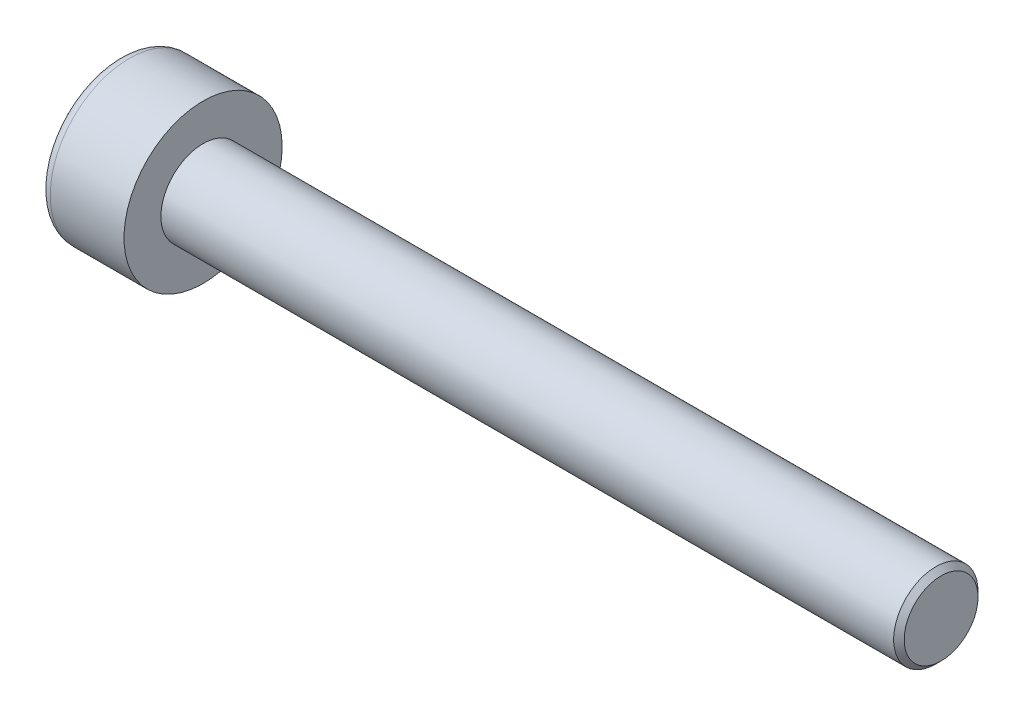
ISO-10303-21;
HEADER;
FILE_DESCRIPTION(('STEP AP214'),'2;1');
FILE_NAME('part.step','',(''),(''),'','','');
FILE_SCHEMA(('AUTOMOTIVE_DESIGN { 1 0 10303 214 1 1 1 1 }'));
ENDSEC;
DATA;
#1=APPLICATION_CONTEXT('core data for automotive mechanical design processes');
#2=APPLICATION_PROTOCOL_DEFINITION('international standard','automotive_design',2000,#1);
#3=PRODUCT_CONTEXT('',#1,'mechanical');
#4=PRODUCT('Part','Part','',(#3));
#5=PRODUCT_RELATED_PRODUCT_CATEGORY('part','',(#4));
#6=PRODUCT_DEFINITION_FORMATION('','',#4);
#7=PRODUCT_DEFINITION_CONTEXT('part definition',#1,'design');
#8=PRODUCT_DEFINITION('design','',#6,#7);
#9=PRODUCT_DEFINITION_SHAPE('','',#8);
#10=(LENGTH_UNIT() NAMED_UNIT(*) SI_UNIT(.MILLI.,.METRE.));
#11=(NAMED_UNIT(*) PLANE_ANGLE_UNIT() SI_UNIT($,.RADIAN.));
#12=(NAMED_UNIT(*) SI_UNIT($,.STERADIAN.) SOLID_ANGLE_UNIT());
#13=UNCERTAINTY_MEASURE_WITH_UNIT(LENGTH_MEASURE(1.E-05),#10,'distance_accuracy_value','');
#14=(GEOMETRIC_REPRESENTATION_CONTEXT(3) GLOBAL_UNCERTAINTY_ASSIGNED_CONTEXT((#13)) GLOBAL_UNIT_ASSIGNED_CONTEXT((#10,
#11,#12)) REPRESENTATION_CONTEXT('',''));
#15=CARTESIAN_POINT('',(0.,0.,0.));
#16=DIRECTION('',(0.,0.,1.));
#17=DIRECTION('',(1.,0.,0.));
#18=AXIS2_PLACEMENT_3D('',#15,#16,#17);
#19=CARTESIAN_POINT('',(0.7,0.,-0.866025403784446));
#20=DIRECTION('',(1.,0.,0.));
#21=DIRECTION('',(0.,0.,-1.));
#22=AXIS2_PLACEMENT_3D('',#19,#20,#21);
#23=PLANE('',#22);
#24=CARTESIAN_POINT('',(0.7,0.,0.));
#25=DIRECTION('',(1.,0.,0.));
#26=DIRECTION('',(0.,0.,-1.));
#27=AXIS2_PLACEMENT_3D('',#24,#25,#26);
#28=CIRCLE('',#27,0.750000000000004);
#29=CARTESIAN_POINT('',(0.7,-0.375000000000009,-0.649519052838328));
#30=VERTEX_POINT('',#29);
#31=CARTESIAN_POINT('',(0.7,-0.750000000000004,0.));
#32=VERTEX_POINT('',#31);
#33=EDGE_CURVE('E160',#30,#32,#28,.F.);
#34=ORIENTED_EDGE('',*,*,#33,.F.);
#35=DIRECTION('',(0.,0.866025403784433,-0.50000000000001));
#36=VECTOR('',#35,1.);
#37=CARTESIAN_POINT('',(0.7,-0.75,-0.43301270189222));
#38=LINE('',#37,#36);
#39=CARTESIAN_POINT('',(0.7,-0.75,-0.43301270189222));
#40=VERTEX_POINT('',#39);
#41=EDGE_CURVE('E168',#40,#30,#38,.T.);
#42=ORIENTED_EDGE('',*,*,#41,.F.);
#43=DIRECTION('',(0.,0.,-1.));
#44=VECTOR('',#43,1.);
#45=CARTESIAN_POINT('',(0.7,-0.750000000000004,0.433012701892211));
#46=LINE('',#45,#44);
#47=EDGE_CURVE('E185',#32,#40,#46,.T.);
#48=ORIENTED_EDGE('',*,*,#47,.F.);
#49=EDGE_LOOP('',(#34,#42,#48));
#50=FACE_BOUND('',#49,.T.);
#51=ADVANCED_FACE('F37',(#50),#23,.F.);
#52=CARTESIAN_POINT('',(0.7,-0.375000000000007,0.64951905283833));
#53=VERTEX_POINT('',#52);
#54=EDGE_CURVE('E290',#32,#53,#28,.F.);
#55=ORIENTED_EDGE('',*,*,#54,.F.);
#56=CARTESIAN_POINT('',(0.7,-0.750000000000004,0.433012701892211));
#57=VERTEX_POINT('',#56);
#58=EDGE_CURVE('E186',#57,#32,#46,.T.);
#59=ORIENTED_EDGE('',*,*,#58,.F.);
#60=DIRECTION('',(0.,-0.866025403784435,-0.500000000000006));
#61=VECTOR('',#60,1.);
#62=CARTESIAN_POINT('',(0.7,0.,0.866025403784436));
#63=LINE('',#62,#61);
#64=EDGE_CURVE('E181',#53,#57,#63,.T.);
#65=ORIENTED_EDGE('',*,*,#64,.F.);
#66=EDGE_LOOP('',(#55,#59,#65));
#67=FACE_BOUND('',#66,.T.);
#68=ADVANCED_FACE('F126',(#67),#23,.F.);
#69=CARTESIAN_POINT('',(0.7,0.374999999999996,0.649519052838336));
#70=VERTEX_POINT('',#69);
#71=EDGE_CURVE('E286',#53,#70,#28,.F.);
#72=ORIENTED_EDGE('',*,*,#71,.F.);
#73=CARTESIAN_POINT('',(0.7,0.,0.866025403784436));
#74=VERTEX_POINT('',#73);
#75=EDGE_CURVE('E182',#74,#53,#63,.T.);
#76=ORIENTED_EDGE('',*,*,#75,.F.);
#77=DIRECTION('',(0.,-0.866025403784443,0.499999999999991));
#78=VECTOR('',#77,1.);
#79=CARTESIAN_POINT('',(0.7,0.749999999999999,0.433012701892223));
#80=LINE('',#79,#78);
#81=EDGE_CURVE('E177',#70,#74,#80,.T.);
#82=ORIENTED_EDGE('',*,*,#81,.F.);
#83=EDGE_LOOP('',(#72,#76,#82));
#84=FACE_BOUND('',#83,.T.);
#85=ADVANCED_FACE('F132',(#84),#23,.F.);
#86=CARTESIAN_POINT('',(0.7,0.750000000000004,0.));
#87=VERTEX_POINT('',#86);
#88=EDGE_CURVE('E157',#70,#87,#28,.F.);
#89=ORIENTED_EDGE('',*,*,#88,.F.);
#90=CARTESIAN_POINT('',(0.7,0.749999999999999,0.433012701892223));
#91=VERTEX_POINT('',#90);
#92=EDGE_CURVE('E178',#91,#70,#80,.T.);
#93=ORIENTED_EDGE('',*,*,#92,.F.);
#94=DIRECTION('',(0.,0.,1.));
#95=VECTOR('',#94,1.);
#96=CARTESIAN_POINT('',(0.7,0.750000000000006,-0.433012701892211));
#97=LINE('',#96,#95);
#98=EDGE_CURVE('E172',#87,#91,#97,.T.);
#99=ORIENTED_EDGE('',*,*,#98,.F.);
#100=EDGE_LOOP('',(#89,#93,#99));
#101=FACE_BOUND('',#100,.T.);
#102=ADVANCED_FACE('F146',(#101),#23,.F.);
#103=CARTESIAN_POINT('',(0.7,0.,0.));
#104=DIRECTION('',(1.,0.,0.));
#105=DIRECTION('',(0.,0.,-1.));
#106=AXIS2_PLACEMENT_3D('',#103,#104,#105);
#107=CIRCLE('',#106,0.750000000000004);
#108=CARTESIAN_POINT('',(0.7,0.375000000000005,-0.649519052838325));
#109=VERTEX_POINT('',#108);
#110=EDGE_CURVE('E52',#109,#87,#107,.T.);
#111=ORIENTED_EDGE('',*,*,#110,.T.);
#112=CARTESIAN_POINT('',(0.7,0.750000000000006,-0.433012701892211));
#113=VERTEX_POINT('',#112);
#114=EDGE_CURVE('E165',#113,#87,#97,.T.);
#115=ORIENTED_EDGE('',*,*,#114,.F.);
#116=DIRECTION('',(0.,0.866025403784434,0.500000000000008));
#117=VECTOR('',#116,1.);
#118=CARTESIAN_POINT('',(0.7,0.,-0.866025403784446));
#119=LINE('',#118,#117);
#120=EDGE_CURVE('E162',#109,#113,#119,.T.);
#121=ORIENTED_EDGE('',*,*,#120,.F.);
#122=EDGE_LOOP('',(#111,#115,#121));
#123=FACE_BOUND('',#122,.T.);
#124=ADVANCED_FACE('F137',(#123),#23,.F.);
#125=EDGE_CURVE('E150',#109,#30,#28,.F.);
#126=ORIENTED_EDGE('',*,*,#125,.F.);
#127=CARTESIAN_POINT('',(0.7,0.,-0.866025403784446));
#128=VERTEX_POINT('',#127);
#129=EDGE_CURVE('E153',#128,#109,#119,.T.);
#130=ORIENTED_EDGE('',*,*,#129,.F.);
#131=EDGE_CURVE('E155',#30,#128,#38,.T.);
#132=ORIENTED_EDGE('',*,*,#131,.F.);
#133=EDGE_LOOP('',(#126,#130,#132));
#134=FACE_BOUND('',#133,.T.);
#135=ADVANCED_FACE('F128',(#134),#23,.F.);
#136=CARTESIAN_POINT('',(0.,0.,0.));
#137=DIRECTION('',(1.,0.,0.));
#138=DIRECTION('',(0.,0.,-1.));
#139=AXIS2_PLACEMENT_3D('',#136,#137,#138);
#140=PLANE('',#139);
#141=CARTESIAN_POINT('',(0.,0.,0.));
#142=DIRECTION('',(1.,0.,0.));
#143=DIRECTION('',(0.,0.,-1.));
#144=AXIS2_PLACEMENT_3D('',#141,#142,#143);
#145=CIRCLE('',#144,1.3);
#146=CARTESIAN_POINT('',(0.,0.,-1.3));
#147=VERTEX_POINT('',#146);
#148=EDGE_CURVE('E225',#147,#147,#145,.F.);
#149=ORIENTED_EDGE('',*,*,#148,.T.);
#150=EDGE_LOOP('',(#149));
#151=FACE_BOUND('',#150,.T.);
#152=DIRECTION('',(0.,0.866025403784433,-0.50000000000001));
#153=VECTOR('',#152,1.);
#154=CARTESIAN_POINT('',(0.,-0.75,-0.43301270189222));
#155=LINE('',#154,#153);
#156=CARTESIAN_POINT('',(0.,-0.75,-0.43301270189222));
#157=VERTEX_POINT('',#156);
#158=CARTESIAN_POINT('',(0.,0.,-0.866025403784446));
#159=VERTEX_POINT('',#158);
#160=EDGE_CURVE('E60',#157,#159,#155,.T.);
#161=ORIENTED_EDGE('',*,*,#160,.T.);
#162=DIRECTION('',(0.,0.866025403784434,0.500000000000008));
#163=VECTOR('',#162,1.);
#164=CARTESIAN_POINT('',(0.,0.,-0.866025403784446));
#165=LINE('',#164,#163);
#166=CARTESIAN_POINT('',(0.,0.750000000000006,-0.433012701892211));
#167=VERTEX_POINT('',#166);
#168=EDGE_CURVE('E191',#159,#167,#165,.T.);
#169=ORIENTED_EDGE('',*,*,#168,.T.);
#170=DIRECTION('',(0.,0.,1.));
#171=VECTOR('',#170,1.);
#172=CARTESIAN_POINT('',(0.,0.750000000000006,-0.433012701892211));
#173=LINE('',#172,#171);
#174=CARTESIAN_POINT('',(0.,0.749999999999999,0.433012701892223));
#175=VERTEX_POINT('',#174);
#176=EDGE_CURVE('E194',#167,#175,#173,.T.);
#177=ORIENTED_EDGE('',*,*,#176,.T.);
#178=DIRECTION('',(0.,-0.866025403784443,0.499999999999991));
#179=VECTOR('',#178,1.);
#180=CARTESIAN_POINT('',(0.,0.749999999999999,0.433012701892223));
#181=LINE('',#180,#179);
#182=CARTESIAN_POINT('',(0.,0.,0.866025403784436));
#183=VERTEX_POINT('',#182);
#184=EDGE_CURVE('E197',#175,#183,#181,.T.);
#185=ORIENTED_EDGE('',*,*,#184,.T.);
#186=DIRECTION('',(0.,-0.866025403784435,-0.500000000000006));
#187=VECTOR('',#186,1.);
#188=CARTESIAN_POINT('',(0.,0.,0.866025403784436));
#189=LINE('',#188,#187);
#190=CARTESIAN_POINT('',(0.,-0.750000000000004,0.433012701892211));
#191=VERTEX_POINT('',#190);
#192=EDGE_CURVE('E200',#183,#191,#189,.T.);
#193=ORIENTED_EDGE('',*,*,#192,.T.);
#194=DIRECTION('',(0.,0.,-1.));
#195=VECTOR('',#194,1.);
#196=CARTESIAN_POINT('',(0.,-0.750000000000004,0.433012701892211));
#197=LINE('',#196,#195);
#198=EDGE_CURVE('E203',#191,#157,#197,.T.);
#199=ORIENTED_EDGE('',*,*,#198,.T.);
#200=EDGE_LOOP('',(#161,#169,#177,#185,#193,#199));
#201=FACE_BOUND('',#200,.T.);
#202=ADVANCED_FACE('F136',(#151,#201),#140,.F.);
#203=CARTESIAN_POINT('',(1.6,0.,0.));
#204=DIRECTION('',(1.,0.,0.));
#205=DIRECTION('',(0.,0.,-1.));
#206=AXIS2_PLACEMENT_3D('',#203,#204,#205);
#207=PLANE('',#206);
#208=CARTESIAN_POINT('',(1.6,0.,0.));
#209=DIRECTION('',(1.,0.,0.));
#210=DIRECTION('',(0.,0.,-1.));
#211=AXIS2_PLACEMENT_3D('',#208,#209,#210);
#212=CIRCLE('',#211,1.5);
#213=CARTESIAN_POINT('',(1.6,0.,-1.5));
#214=VERTEX_POINT('',#213);
#215=EDGE_CURVE('E158',#214,#214,#212,.T.);
#216=ORIENTED_EDGE('',*,*,#215,.T.);
#217=EDGE_LOOP('',(#216));
#218=FACE_BOUND('',#217,.T.);
#219=CARTESIAN_POINT('',(1.6,0.,0.));
#220=DIRECTION('',(1.,0.,0.));
#221=DIRECTION('',(0.,0.,-1.));
#222=AXIS2_PLACEMENT_3D('',#219,#220,#221);
#223=CIRCLE('',#222,0.8);
#224=CARTESIAN_POINT('',(1.6,0.,-0.8));
#225=VERTEX_POINT('',#224);
#226=EDGE_CURVE('E216',#225,#225,#223,.T.);
#227=ORIENTED_EDGE('',*,*,#226,.F.);
#228=EDGE_LOOP('',(#227));
#229=FACE_BOUND('',#228,.T.);
#230=ADVANCED_FACE('F143',(#218,#229),#207,.T.);
#231=CARTESIAN_POINT('',(1.6,0.,0.));
#232=DIRECTION('',(-1.,0.,0.));
#233=DIRECTION('',(0.,0.,1.));
#234=AXIS2_PLACEMENT_3D('',#231,#232,#233);
#235=CYLINDRICAL_SURFACE('',#234,1.5);
#236=CARTESIAN_POINT('',(0.2,0.,0.));
#237=DIRECTION('',(1.,0.,0.));
#238=DIRECTION('',(0.,0.,-1.));
#239=AXIS2_PLACEMENT_3D('',#236,#237,#238);
#240=CIRCLE('',#239,1.5);
#241=CARTESIAN_POINT('',(0.2,0.,-1.5));
#242=VERTEX_POINT('',#241);
#243=EDGE_CURVE('E222',#242,#242,#240,.T.);
#244=ORIENTED_EDGE('',*,*,#243,.T.);
#245=EDGE_LOOP('',(#244));
#246=FACE_BOUND('',#245,.T.);
#247=ORIENTED_EDGE('',*,*,#215,.F.);
#248=EDGE_LOOP('',(#247));
#249=FACE_BOUND('',#248,.T.);
#250=ADVANCED_FACE('F241',(#246,#249),#235,.T.);
#251=CARTESIAN_POINT('',(15.6,0.,0.));
#252=DIRECTION('',(-1.,0.,0.));
#253=DIRECTION('',(0.,0.,1.));
#254=AXIS2_PLACEMENT_3D('',#251,#252,#253);
#255=CYLINDRICAL_SURFACE('',#254,0.8);
#256=CARTESIAN_POINT('',(15.5,0.,0.));
#257=DIRECTION('',(1.,0.,0.));
#258=DIRECTION('',(0.,0.,-1.));
#259=AXIS2_PLACEMENT_3D('',#256,#257,#258);
#260=CIRCLE('',#259,0.8);
#261=CARTESIAN_POINT('',(15.5,0.,-0.8));
#262=VERTEX_POINT('',#261);
#263=EDGE_CURVE('E11',#262,#262,#260,.F.);
#264=ORIENTED_EDGE('',*,*,#263,.T.);
#265=EDGE_LOOP('',(#264));
#266=FACE_BOUND('',#265,.T.);
#267=ORIENTED_EDGE('',*,*,#226,.T.);
#268=EDGE_LOOP('',(#267));
#269=FACE_BOUND('',#268,.T.);
#270=ADVANCED_FACE('F238',(#266,#269),#255,.T.);
#271=CARTESIAN_POINT('',(15.6,0.,0.));
#272=DIRECTION('',(1.,0.,0.));
#273=DIRECTION('',(0.,0.,-1.));
#274=AXIS2_PLACEMENT_3D('',#271,#272,#273);
#275=PLANE('',#274);
#276=CARTESIAN_POINT('',(15.6,0.,0.));
#277=DIRECTION('',(1.,0.,0.));
#278=DIRECTION('',(0.,0.,-1.));
#279=AXIS2_PLACEMENT_3D('',#276,#277,#278);
#280=CIRCLE('',#279,0.699999999999998);
#281=CARTESIAN_POINT('',(15.6,0.,-0.699999999999998));
#282=VERTEX_POINT('',#281);
#283=EDGE_CURVE('E45',#282,#282,#280,.T.);
#284=ORIENTED_EDGE('',*,*,#283,.T.);
#285=EDGE_LOOP('',(#284));
#286=FACE_BOUND('',#285,.T.);
#287=ADVANCED_FACE('F230',(#286),#275,.T.);
#288=CARTESIAN_POINT('',(0.7,-0.75,-0.43301270189222));
#289=DIRECTION('',(0.,0.50000000000001,0.866025403784433));
#290=DIRECTION('',(0.,-0.866025403784433,0.50000000000001));
#291=AXIS2_PLACEMENT_3D('',#288,#289,#290);
#292=PLANE('',#291);
#293=ORIENTED_EDGE('',*,*,#160,.F.);
#294=DIRECTION('',(-1.,0.,0.));
#295=VECTOR('',#294,1.);
#296=CARTESIAN_POINT('',(0.7,-0.75,-0.43301270189222));
#297=LINE('',#296,#295);
#298=EDGE_CURVE('E189',#40,#157,#297,.T.);
#299=ORIENTED_EDGE('',*,*,#298,.F.);
#300=ORIENTED_EDGE('',*,*,#41,.T.);
#301=ORIENTED_EDGE('',*,*,#131,.T.);
#302=DIRECTION('',(-1.,0.,0.));
#303=VECTOR('',#302,1.);
#304=CARTESIAN_POINT('',(0.7,0.,-0.866025403784446));
#305=LINE('',#304,#303);
#306=EDGE_CURVE('E171',#128,#159,#305,.T.);
#307=ORIENTED_EDGE('',*,*,#306,.T.);
#308=EDGE_LOOP('',(#293,#299,#300,#301,#307));
#309=FACE_BOUND('',#308,.T.);
#310=ADVANCED_FACE('F256',(#309),#292,.T.);
#311=CARTESIAN_POINT('',(0.7,0.,-0.866025403784446));
#312=DIRECTION('',(0.,-0.500000000000008,0.866025403784434));
#313=DIRECTION('',(0.,-0.866025403784434,-0.500000000000008));
#314=AXIS2_PLACEMENT_3D('',#311,#312,#313);
#315=PLANE('',#314);
#316=ORIENTED_EDGE('',*,*,#168,.F.);
#317=ORIENTED_EDGE('',*,*,#306,.F.);
#318=ORIENTED_EDGE('',*,*,#129,.T.);
#319=ORIENTED_EDGE('',*,*,#120,.T.);
#320=DIRECTION('',(-1.,0.,0.));
#321=VECTOR('',#320,1.);
#322=CARTESIAN_POINT('',(0.7,0.750000000000006,-0.433012701892211));
#323=LINE('',#322,#321);
#324=EDGE_CURVE('E213',#113,#167,#323,.T.);
#325=ORIENTED_EDGE('',*,*,#324,.T.);
#326=EDGE_LOOP('',(#316,#317,#318,#319,#325));
#327=FACE_BOUND('',#326,.T.);
#328=ADVANCED_FACE('F170',(#327),#315,.T.);
#329=CARTESIAN_POINT('',(0.7,0.750000000000006,-0.433012701892211));
#330=DIRECTION('',(0.,-1.,0.));
#331=DIRECTION('',(0.,0.,-1.));
#332=AXIS2_PLACEMENT_3D('',#329,#330,#331);
#333=PLANE('',#332);
#334=ORIENTED_EDGE('',*,*,#176,.F.);
#335=ORIENTED_EDGE('',*,*,#324,.F.);
#336=ORIENTED_EDGE('',*,*,#114,.T.);
#337=ORIENTED_EDGE('',*,*,#98,.T.);
#338=DIRECTION('',(-1.,0.,0.));
#339=VECTOR('',#338,1.);
#340=CARTESIAN_POINT('',(0.7,0.749999999999999,0.433012701892223));
#341=LINE('',#340,#339);
#342=EDGE_CURVE('E211',#91,#175,#341,.T.);
#343=ORIENTED_EDGE('',*,*,#342,.T.);
#344=EDGE_LOOP('',(#334,#335,#336,#337,#343));
#345=FACE_BOUND('',#344,.T.);
#346=ADVANCED_FACE('F261',(#345),#333,.T.);
#347=CARTESIAN_POINT('',(0.7,0.749999999999999,0.433012701892223));
#348=DIRECTION('',(0.,-0.499999999999992,-0.866025403784444));
#349=DIRECTION('',(0.,0.866025403784444,-0.499999999999992));
#350=AXIS2_PLACEMENT_3D('',#347,#348,#349);
#351=PLANE('',#350);
#352=ORIENTED_EDGE('',*,*,#184,.F.);
#353=ORIENTED_EDGE('',*,*,#342,.F.);
#354=ORIENTED_EDGE('',*,*,#92,.T.);
#355=ORIENTED_EDGE('',*,*,#81,.T.);
#356=DIRECTION('',(-1.,0.,0.));
#357=VECTOR('',#356,1.);
#358=CARTESIAN_POINT('',(0.7,0.,0.866025403784436));
#359=LINE('',#358,#357);
#360=EDGE_CURVE('E209',#74,#183,#359,.T.);
#361=ORIENTED_EDGE('',*,*,#360,.T.);
#362=EDGE_LOOP('',(#352,#353,#354,#355,#361));
#363=FACE_BOUND('',#362,.T.);
#364=ADVANCED_FACE('F264',(#363),#351,.T.);
#365=CARTESIAN_POINT('',(0.7,0.,0.866025403784436));
#366=DIRECTION('',(0.,0.500000000000006,-0.866025403784435));
#367=DIRECTION('',(0.,0.866025403784435,0.500000000000006));
#368=AXIS2_PLACEMENT_3D('',#365,#366,#367);
#369=PLANE('',#368);
#370=ORIENTED_EDGE('',*,*,#192,.F.);
#371=ORIENTED_EDGE('',*,*,#360,.F.);
#372=ORIENTED_EDGE('',*,*,#75,.T.);
#373=ORIENTED_EDGE('',*,*,#64,.T.);
#374=DIRECTION('',(-1.,0.,0.));
#375=VECTOR('',#374,1.);
#376=CARTESIAN_POINT('',(0.7,-0.750000000000004,0.433012701892211));
#377=LINE('',#376,#375);
#378=EDGE_CURVE('E207',#57,#191,#377,.T.);
#379=ORIENTED_EDGE('',*,*,#378,.T.);
#380=EDGE_LOOP('',(#370,#371,#372,#373,#379));
#381=FACE_BOUND('',#380,.T.);
#382=ADVANCED_FACE('F121',(#381),#369,.T.);
#383=CARTESIAN_POINT('',(0.7,-0.750000000000004,0.433012701892211));
#384=DIRECTION('',(0.,1.,0.));
#385=DIRECTION('',(0.,0.,1.));
#386=AXIS2_PLACEMENT_3D('',#383,#384,#385);
#387=PLANE('',#386);
#388=ORIENTED_EDGE('',*,*,#198,.F.);
#389=ORIENTED_EDGE('',*,*,#378,.F.);
#390=ORIENTED_EDGE('',*,*,#58,.T.);
#391=ORIENTED_EDGE('',*,*,#47,.T.);
#392=ORIENTED_EDGE('',*,*,#298,.T.);
#393=EDGE_LOOP('',(#388,#389,#390,#391,#392));
#394=FACE_BOUND('',#393,.T.);
#395=ADVANCED_FACE('F114',(#394),#387,.T.);
#396=CARTESIAN_POINT('',(0.7,0.,0.));
#397=DIRECTION('',(-1.,0.,0.));
#398=DIRECTION('',(0.,0.,1.));
#399=AXIS2_PLACEMENT_3D('',#396,#397,#398);
#400=CONICAL_SURFACE('',#399,0.750000000000004,1.04719755119659);
#401=CARTESIAN_POINT('',(1.13301270189223,0.,0.));
#402=VERTEX_POINT('',#401);
#403=VERTEX_LOOP('',#402);
#404=FACE_BOUND('',#403,.T.);
#405=ORIENTED_EDGE('',*,*,#110,.F.);
#406=ORIENTED_EDGE('',*,*,#125,.T.);
#407=ORIENTED_EDGE('',*,*,#33,.T.);
#408=ORIENTED_EDGE('',*,*,#54,.T.);
#409=ORIENTED_EDGE('',*,*,#71,.T.);
#410=ORIENTED_EDGE('',*,*,#88,.T.);
#411=EDGE_LOOP('',(#405,#406,#407,#408,#409,#410));
#412=FACE_BOUND('',#411,.T.);
#413=ADVANCED_FACE('F111',(#404,#412),#400,.F.);
#414=CARTESIAN_POINT('',(0.2,0.,0.));
#415=DIRECTION('',(1.,0.,0.));
#416=DIRECTION('',(0.,0.,-1.));
#417=AXIS2_PLACEMENT_3D('',#414,#415,#416);
#418=TOROIDAL_SURFACE('',#417,1.3,0.2);
#419=ORIENTED_EDGE('',*,*,#148,.F.);
#420=EDGE_LOOP('',(#419));
#421=FACE_BOUND('',#420,.T.);
#422=ORIENTED_EDGE('',*,*,#243,.F.);
#423=EDGE_LOOP('',(#422));
#424=FACE_BOUND('',#423,.T.);
#425=ADVANCED_FACE('F113',(#421,#424),#418,.T.);
#426=CARTESIAN_POINT('',(15.6,0.,0.));
#427=DIRECTION('',(-1.,0.,0.));
#428=DIRECTION('',(0.,0.,1.));
#429=AXIS2_PLACEMENT_3D('',#426,#427,#428);
#430=CONICAL_SURFACE('',#429,0.699999999999998,0.785398163397447);
#431=ORIENTED_EDGE('',*,*,#263,.F.);
#432=EDGE_LOOP('',(#431));
#433=FACE_BOUND('',#432,.T.);
#434=ORIENTED_EDGE('',*,*,#283,.F.);
#435=EDGE_LOOP('',(#434));
#436=FACE_BOUND('',#435,.T.);
#437=ADVANCED_FACE('F39',(#433,#436),#430,.T.);
#438=CLOSED_SHELL('',(#51,#68,#85,#102,#124,#135,#202,#230,#250,#270,#287,#310,#328,#346,#364,
#382,#395,#413,#425,#437));
#439=MANIFOLD_SOLID_BREP('B2',#438);
#440=ADVANCED_BREP_SHAPE_REPRESENTATION('',(#18,#439),#14);
#441=SHAPE_DEFINITION_REPRESENTATION(#9,#440);
ENDSEC;
END-ISO-10303-21;
